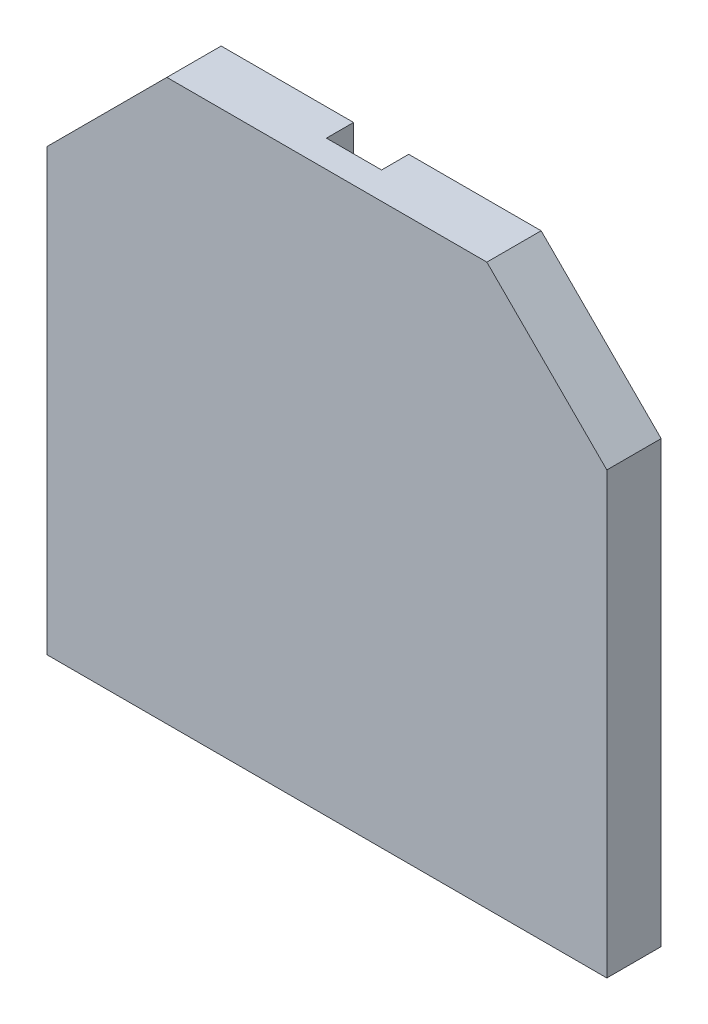
ISO-10303-21;
HEADER;
FILE_DESCRIPTION(('STEP AP214'),'2;1');
FILE_NAME('part.step','',(''),(''),'','','');
FILE_SCHEMA(('AUTOMOTIVE_DESIGN { 1 0 10303 214 1 1 1 1 }'));
ENDSEC;
DATA;
#1=APPLICATION_CONTEXT('core data for automotive mechanical design processes');
#2=APPLICATION_PROTOCOL_DEFINITION('international standard','automotive_design',2000,#1);
#3=PRODUCT_CONTEXT('',#1,'mechanical');
#4=PRODUCT('Part','Part','',(#3));
#5=PRODUCT_RELATED_PRODUCT_CATEGORY('part','',(#4));
#6=PRODUCT_DEFINITION_FORMATION('','',#4);
#7=PRODUCT_DEFINITION_CONTEXT('part definition',#1,'design');
#8=PRODUCT_DEFINITION('design','',#6,#7);
#9=PRODUCT_DEFINITION_SHAPE('','',#8);
#10=(LENGTH_UNIT() NAMED_UNIT(*) SI_UNIT(.MILLI.,.METRE.));
#11=(NAMED_UNIT(*) PLANE_ANGLE_UNIT() SI_UNIT($,.RADIAN.));
#12=(NAMED_UNIT(*) SI_UNIT($,.STERADIAN.) SOLID_ANGLE_UNIT());
#13=UNCERTAINTY_MEASURE_WITH_UNIT(LENGTH_MEASURE(1.E-05),#10,'distance_accuracy_value','');
#14=(GEOMETRIC_REPRESENTATION_CONTEXT(3) GLOBAL_UNCERTAINTY_ASSIGNED_CONTEXT((#13)) GLOBAL_UNIT_ASSIGNED_CONTEXT((#10,
#11,#12)) REPRESENTATION_CONTEXT('',''));
#15=CARTESIAN_POINT('',(0.,0.,0.));
#16=DIRECTION('',(0.,0.,1.));
#17=DIRECTION('',(1.,0.,0.));
#18=AXIS2_PLACEMENT_3D('',#15,#16,#17);
#19=CARTESIAN_POINT('',(-0.32500316,0.68579492,0.31999936));
#20=DIRECTION('',(0.,0.,-1.));
#21=DIRECTION('',(-1.,0.,0.));
#22=AXIS2_PLACEMENT_3D('',#19,#20,#21);
#23=PLANE('',#22);
#24=DIRECTION('',(-1.,0.,0.));
#25=VECTOR('',#24,1.);
#26=CARTESIAN_POINT('',(-0.32500316,0.48579532,0.31999936));
#27=LINE('',#26,#25);
#28=CARTESIAN_POINT('',(-0.32500316,0.48579532,0.31999936));
#29=VERTEX_POINT('',#28);
#30=CARTESIAN_POINT('',(0.32499808,0.48579532,0.31999936));
#31=VERTEX_POINT('',#30);
#32=EDGE_CURVE('E20',#29,#31,#27,.F.);
#33=ORIENTED_EDGE('',*,*,#32,.T.);
#34=DIRECTION('',(0.,1.,0.));
#35=VECTOR('',#34,1.);
#36=CARTESIAN_POINT('',(0.32499808,-1.91420496,0.31999936));
#37=LINE('',#36,#35);
#38=CARTESIAN_POINT('',(0.32499808,-1.91420496,0.31999936));
#39=VERTEX_POINT('',#38);
#40=EDGE_CURVE('E115',#39,#31,#37,.T.);
#41=ORIENTED_EDGE('',*,*,#40,.F.);
#42=DIRECTION('',(1.,0.,0.));
#43=VECTOR('',#42,1.);
#44=CARTESIAN_POINT('',(-0.32500316,-1.91420496,0.31999936));
#45=LINE('',#44,#43);
#46=CARTESIAN_POINT('',(-0.32500316,-1.91420496,0.31999936));
#47=VERTEX_POINT('',#46);
#48=EDGE_CURVE('E132',#47,#39,#45,.T.);
#49=ORIENTED_EDGE('',*,*,#48,.F.);
#50=DIRECTION('',(0.,1.,0.));
#51=VECTOR('',#50,1.);
#52=CARTESIAN_POINT('',(-0.32500316,0.68579492,0.31999936));
#53=LINE('',#52,#51);
#54=EDGE_CURVE('E120',#29,#47,#53,.F.);
#55=ORIENTED_EDGE('',*,*,#54,.F.);
#56=EDGE_LOOP('',(#33,#41,#49,#55));
#57=FACE_BOUND('',#56,.T.);
#58=ADVANCED_FACE('F17',(#57),#23,.T.);
#59=CARTESIAN_POINT('',(-0.32500316,-3.71420136,0.31999936));
#60=DIRECTION('',(0.,0.,-1.));
#61=DIRECTION('',(-1.,0.,0.));
#62=AXIS2_PLACEMENT_3D('',#59,#60,#61);
#63=PLANE('',#62);
#64=DIRECTION('',(-1.,0.,0.));
#65=VECTOR('',#64,1.);
#66=CARTESIAN_POINT('',(-0.32500316,-6.11420164,0.31999936));
#67=LINE('',#66,#65);
#68=CARTESIAN_POINT('',(0.32499808,-6.11420164,0.31999936));
#69=VERTEX_POINT('',#68);
#70=CARTESIAN_POINT('',(-0.32500316,-6.11420164,0.31999936));
#71=VERTEX_POINT('',#70);
#72=EDGE_CURVE('E123',#69,#71,#67,.T.);
#73=ORIENTED_EDGE('',*,*,#72,.T.);
#74=DIRECTION('',(0.,1.,0.));
#75=VECTOR('',#74,1.);
#76=CARTESIAN_POINT('',(-0.32500316,-3.71420136,0.31999936));
#77=LINE('',#76,#75);
#78=CARTESIAN_POINT('',(-0.32500316,-3.71420136,0.31999936));
#79=VERTEX_POINT('',#78);
#80=EDGE_CURVE('E148',#79,#71,#77,.F.);
#81=ORIENTED_EDGE('',*,*,#80,.F.);
#82=DIRECTION('',(1.,0.,0.));
#83=VECTOR('',#82,1.);
#84=CARTESIAN_POINT('',(0.32499808,-3.71420136,0.31999936));
#85=LINE('',#84,#83);
#86=CARTESIAN_POINT('',(0.32499808,-3.71420136,0.31999936));
#87=VERTEX_POINT('',#86);
#88=EDGE_CURVE('E153',#87,#79,#85,.F.);
#89=ORIENTED_EDGE('',*,*,#88,.F.);
#90=DIRECTION('',(0.,1.,0.));
#91=VECTOR('',#90,1.);
#92=CARTESIAN_POINT('',(0.32499808,-6.31420124,0.31999936));
#93=LINE('',#92,#91);
#94=EDGE_CURVE('E165',#69,#87,#93,.T.);
#95=ORIENTED_EDGE('',*,*,#94,.F.);
#96=EDGE_LOOP('',(#73,#81,#89,#95));
#97=FACE_BOUND('',#96,.T.);
#98=ADVANCED_FACE('F251',(#97),#63,.T.);
#99=CARTESIAN_POINT('',(0.32499808,-1.91420496,-1.00000054));
#100=DIRECTION('',(-1.,0.,0.));
#101=DIRECTION('',(0.,0.,1.));
#102=AXIS2_PLACEMENT_3D('',#99,#100,#101);
#103=PLANE('',#102);
#104=DIRECTION('',(0.,0.,1.));
#105=VECTOR('',#104,1.);
#106=CARTESIAN_POINT('',(0.32499808,0.48579532,-1.00000054));
#107=LINE('',#106,#105);
#108=CARTESIAN_POINT('',(0.32499808,0.48579532,0.));
#109=VERTEX_POINT('',#108);
#110=EDGE_CURVE('E125',#31,#109,#107,.F.);
#111=ORIENTED_EDGE('',*,*,#110,.T.);
#112=DIRECTION('',(0.,1.,0.));
#113=VECTOR('',#112,1.);
#114=CARTESIAN_POINT('',(0.32499808,0.48579532,0.));
#115=LINE('',#114,#113);
#116=CARTESIAN_POINT('',(0.32499808,-1.91420496,0.));
#117=VERTEX_POINT('',#116);
#118=EDGE_CURVE('E168',#109,#117,#115,.F.);
#119=ORIENTED_EDGE('',*,*,#118,.T.);
#120=DIRECTION('',(0.,0.,1.));
#121=VECTOR('',#120,1.);
#122=CARTESIAN_POINT('',(0.32499808,-1.91420496,-1.00000054));
#123=LINE('',#122,#121);
#124=EDGE_CURVE('E136',#39,#117,#123,.F.);
#125=ORIENTED_EDGE('',*,*,#124,.F.);
#126=ORIENTED_EDGE('',*,*,#40,.T.);
#127=EDGE_LOOP('',(#111,#119,#125,#126));
#128=FACE_BOUND('',#127,.T.);
#129=ADVANCED_FACE('F134',(#128),#103,.T.);
#130=CARTESIAN_POINT('',(-0.32500316,-1.91420496,-1.00000054));
#131=DIRECTION('',(0.,1.,0.));
#132=DIRECTION('',(0.,0.,1.));
#133=AXIS2_PLACEMENT_3D('',#130,#131,#132);
#134=PLANE('',#133);
#135=ORIENTED_EDGE('',*,*,#124,.T.);
#136=DIRECTION('',(1.,0.,0.));
#137=VECTOR('',#136,1.);
#138=CARTESIAN_POINT('',(-1.88578998,-1.91420496,0.));
#139=LINE('',#138,#137);
#140=CARTESIAN_POINT('',(-0.32500316,-1.91420496,0.));
#141=VERTEX_POINT('',#140);
#142=EDGE_CURVE('E170',#117,#141,#139,.F.);
#143=ORIENTED_EDGE('',*,*,#142,.T.);
#144=DIRECTION('',(0.,0.,-1.));
#145=VECTOR('',#144,1.);
#146=CARTESIAN_POINT('',(-0.32500316,-1.91420496,-1.00000054));
#147=LINE('',#146,#145);
#148=EDGE_CURVE('E142',#47,#141,#147,.T.);
#149=ORIENTED_EDGE('',*,*,#148,.F.);
#150=ORIENTED_EDGE('',*,*,#48,.T.);
#151=EDGE_LOOP('',(#135,#143,#149,#150));
#152=FACE_BOUND('',#151,.T.);
#153=ADVANCED_FACE('F271',(#152),#134,.T.);
#154=CARTESIAN_POINT('',(-0.32500316,0.68579492,-1.00000054));
#155=DIRECTION('',(1.,0.,0.));
#156=DIRECTION('',(0.,0.,-1.));
#157=AXIS2_PLACEMENT_3D('',#154,#155,#156);
#158=PLANE('',#157);
#159=DIRECTION('',(0.,0.,-1.));
#160=VECTOR('',#159,1.);
#161=CARTESIAN_POINT('',(-0.32500316,0.48579532,-1.00000054));
#162=LINE('',#161,#160);
#163=CARTESIAN_POINT('',(-0.32500316,0.48579532,0.));
#164=VERTEX_POINT('',#163);
#165=EDGE_CURVE('E145',#164,#29,#162,.F.);
#166=ORIENTED_EDGE('',*,*,#165,.T.);
#167=ORIENTED_EDGE('',*,*,#54,.T.);
#168=ORIENTED_EDGE('',*,*,#148,.T.);
#169=DIRECTION('',(0.,1.,0.));
#170=VECTOR('',#169,1.);
#171=CARTESIAN_POINT('',(-0.32500316,0.48579532,0.));
#172=LINE('',#171,#170);
#173=EDGE_CURVE('E172',#141,#164,#172,.T.);
#174=ORIENTED_EDGE('',*,*,#173,.T.);
#175=EDGE_LOOP('',(#166,#167,#168,#174));
#176=FACE_BOUND('',#175,.T.);
#177=ADVANCED_FACE('F268',(#176),#158,.T.);
#178=CARTESIAN_POINT('',(-0.32500316,-3.71420136,-1.00000054));
#179=DIRECTION('',(1.,0.,0.));
#180=DIRECTION('',(0.,0.,-1.));
#181=AXIS2_PLACEMENT_3D('',#178,#179,#180);
#182=PLANE('',#181);
#183=DIRECTION('',(0.,0.,-1.));
#184=VECTOR('',#183,1.);
#185=CARTESIAN_POINT('',(-0.32500316,-6.11420164,-1.00000054));
#186=LINE('',#185,#184);
#187=CARTESIAN_POINT('',(-0.32500316,-6.11420164,0.));
#188=VERTEX_POINT('',#187);
#189=EDGE_CURVE('E151',#71,#188,#186,.T.);
#190=ORIENTED_EDGE('',*,*,#189,.T.);
#191=DIRECTION('',(0.,1.,0.));
#192=VECTOR('',#191,1.);
#193=CARTESIAN_POINT('',(-0.32500316,0.48579532,0.));
#194=LINE('',#193,#192);
#195=CARTESIAN_POINT('',(-0.32500316,-3.71420136,0.));
#196=VERTEX_POINT('',#195);
#197=EDGE_CURVE('E175',#188,#196,#194,.T.);
#198=ORIENTED_EDGE('',*,*,#197,.T.);
#199=DIRECTION('',(0.,0.,-1.));
#200=VECTOR('',#199,1.);
#201=CARTESIAN_POINT('',(-0.32500316,-3.71420136,-1.00000054));
#202=LINE('',#201,#200);
#203=EDGE_CURVE('E156',#79,#196,#202,.T.);
#204=ORIENTED_EDGE('',*,*,#203,.F.);
#205=ORIENTED_EDGE('',*,*,#80,.T.);
#206=EDGE_LOOP('',(#190,#198,#204,#205));
#207=FACE_BOUND('',#206,.T.);
#208=ADVANCED_FACE('F245',(#207),#182,.T.);
#209=CARTESIAN_POINT('',(0.32499808,-3.71420136,-1.00000054));
#210=DIRECTION('',(0.,-1.,0.));
#211=DIRECTION('',(0.,0.,-1.));
#212=AXIS2_PLACEMENT_3D('',#209,#210,#211);
#213=PLANE('',#212);
#214=ORIENTED_EDGE('',*,*,#203,.T.);
#215=DIRECTION('',(1.,0.,0.));
#216=VECTOR('',#215,1.);
#217=CARTESIAN_POINT('',(-1.88578998,-3.71420136,0.));
#218=LINE('',#217,#216);
#219=CARTESIAN_POINT('',(0.32499808,-3.71420136,0.));
#220=VERTEX_POINT('',#219);
#221=EDGE_CURVE('E177',#196,#220,#218,.T.);
#222=ORIENTED_EDGE('',*,*,#221,.T.);
#223=DIRECTION('',(0.,0.,1.));
#224=VECTOR('',#223,1.);
#225=CARTESIAN_POINT('',(0.32499808,-3.71420136,-1.00000054));
#226=LINE('',#225,#224);
#227=EDGE_CURVE('E159',#87,#220,#226,.F.);
#228=ORIENTED_EDGE('',*,*,#227,.F.);
#229=ORIENTED_EDGE('',*,*,#88,.T.);
#230=EDGE_LOOP('',(#214,#222,#228,#229));
#231=FACE_BOUND('',#230,.T.);
#232=ADVANCED_FACE('F247',(#231),#213,.T.);
#233=CARTESIAN_POINT('',(0.32499808,-6.31420124,-1.00000054));
#234=DIRECTION('',(-1.,0.,0.));
#235=DIRECTION('',(0.,0.,1.));
#236=AXIS2_PLACEMENT_3D('',#233,#234,#235);
#237=PLANE('',#236);
#238=DIRECTION('',(0.,0.,1.));
#239=VECTOR('',#238,1.);
#240=CARTESIAN_POINT('',(0.32499808,-6.11420164,-1.00000054));
#241=LINE('',#240,#239);
#242=CARTESIAN_POINT('',(0.32499808,-6.11420164,0.));
#243=VERTEX_POINT('',#242);
#244=EDGE_CURVE('E162',#243,#69,#241,.T.);
#245=ORIENTED_EDGE('',*,*,#244,.T.);
#246=ORIENTED_EDGE('',*,*,#94,.T.);
#247=ORIENTED_EDGE('',*,*,#227,.T.);
#248=DIRECTION('',(0.,1.,0.));
#249=VECTOR('',#248,1.);
#250=CARTESIAN_POINT('',(0.32499808,0.48579532,0.));
#251=LINE('',#250,#249);
#252=EDGE_CURVE('E179',#220,#243,#251,.F.);
#253=ORIENTED_EDGE('',*,*,#252,.T.);
#254=EDGE_LOOP('',(#245,#246,#247,#253));
#255=FACE_BOUND('',#254,.T.);
#256=ADVANCED_FACE('F255',(#255),#237,.T.);
#257=CARTESIAN_POINT('',(-1.88578998,0.48579532,0.));
#258=DIRECTION('',(0.,0.,1.));
#259=DIRECTION('',(1.,0.,0.));
#260=AXIS2_PLACEMENT_3D('',#257,#258,#259);
#261=PLANE('',#260);
#262=DIRECTION('',(-0.707106781186548,0.707106781186548,0.));
#263=VECTOR('',#262,1.);
#264=CARTESIAN_POINT('',(1.8857849,0.48579532,0.));
#265=LINE('',#264,#263);
#266=CARTESIAN_POINT('',(3.29999848,-0.92841826,0.));
#267=VERTEX_POINT('',#266);
#268=CARTESIAN_POINT('',(1.8857849,0.48579532,0.));
#269=VERTEX_POINT('',#268);
#270=EDGE_CURVE('E182',#267,#269,#265,.T.);
#271=ORIENTED_EDGE('',*,*,#270,.F.);
#272=DIRECTION('',(0.,1.,0.));
#273=VECTOR('',#272,1.);
#274=CARTESIAN_POINT('',(3.29999848,-0.92841826,0.));
#275=LINE('',#274,#273);
#276=CARTESIAN_POINT('',(3.29999848,-6.11420164,0.));
#277=VERTEX_POINT('',#276);
#278=EDGE_CURVE('E209',#277,#267,#275,.T.);
#279=ORIENTED_EDGE('',*,*,#278,.F.);
#280=DIRECTION('',(1.,0.,0.));
#281=VECTOR('',#280,1.);
#282=CARTESIAN_POINT('',(3.29999848,-6.11420164,0.));
#283=LINE('',#282,#281);
#284=EDGE_CURVE('E206',#243,#277,#283,.T.);
#285=ORIENTED_EDGE('',*,*,#284,.F.);
#286=ORIENTED_EDGE('',*,*,#252,.F.);
#287=ORIENTED_EDGE('',*,*,#221,.F.);
#288=ORIENTED_EDGE('',*,*,#197,.F.);
#289=DIRECTION('',(1.,0.,0.));
#290=VECTOR('',#289,1.);
#291=CARTESIAN_POINT('',(3.29999848,-6.11420164,0.));
#292=LINE('',#291,#290);
#293=CARTESIAN_POINT('',(-3.30000356,-6.11420164,0.));
#294=VERTEX_POINT('',#293);
#295=EDGE_CURVE('E203',#294,#188,#292,.T.);
#296=ORIENTED_EDGE('',*,*,#295,.F.);
#297=DIRECTION('',(0.,1.,0.));
#298=VECTOR('',#297,1.);
#299=CARTESIAN_POINT('',(-3.30000356,-6.11420164,0.));
#300=LINE('',#299,#298);
#301=CARTESIAN_POINT('',(-3.30000356,-0.92841826,0.));
#302=VERTEX_POINT('',#301);
#303=EDGE_CURVE('E198',#302,#294,#300,.F.);
#304=ORIENTED_EDGE('',*,*,#303,.F.);
#305=DIRECTION('',(-0.707106781186548,-0.707106781186548,0.));
#306=VECTOR('',#305,1.);
#307=CARTESIAN_POINT('',(-3.30000356,-0.92841826,0.));
#308=LINE('',#307,#306);
#309=CARTESIAN_POINT('',(-1.88578998,0.48579532,0.));
#310=VERTEX_POINT('',#309);
#311=EDGE_CURVE('E193',#310,#302,#308,.T.);
#312=ORIENTED_EDGE('',*,*,#311,.F.);
#313=DIRECTION('',(1.,0.,0.));
#314=VECTOR('',#313,1.);
#315=CARTESIAN_POINT('',(-1.88578998,0.48579532,0.));
#316=LINE('',#315,#314);
#317=EDGE_CURVE('E186',#164,#310,#316,.F.);
#318=ORIENTED_EDGE('',*,*,#317,.F.);
#319=ORIENTED_EDGE('',*,*,#173,.F.);
#320=ORIENTED_EDGE('',*,*,#142,.F.);
#321=ORIENTED_EDGE('',*,*,#118,.F.);
#322=DIRECTION('',(1.,0.,0.));
#323=VECTOR('',#322,1.);
#324=CARTESIAN_POINT('',(-1.88578998,0.48579532,0.));
#325=LINE('',#324,#323);
#326=EDGE_CURVE('E129',#269,#109,#325,.F.);
#327=ORIENTED_EDGE('',*,*,#326,.F.);
#328=EDGE_LOOP('',(#271,#279,#285,#286,#287,#288,#296,#304,#312,#318,#319,#320,#321,#327));
#329=FACE_BOUND('',#328,.T.);
#330=ADVANCED_FACE('F240',(#329),#261,.F.);
#331=CARTESIAN_POINT('',(1.8857849,0.48579532,0.));
#332=DIRECTION('',(0.707106781186548,0.707106781186548,0.));
#333=DIRECTION('',(-0.707106781186548,0.707106781186548,0.));
#334=AXIS2_PLACEMENT_3D('',#331,#332,#333);
#335=PLANE('',#334);
#336=DIRECTION('',(0.,0.,1.));
#337=VECTOR('',#336,1.);
#338=CARTESIAN_POINT('',(1.8857849,0.48579532,0.));
#339=LINE('',#338,#337);
#340=CARTESIAN_POINT('',(1.8857849,0.48579532,0.64000126));
#341=VERTEX_POINT('',#340);
#342=EDGE_CURVE('E188',#341,#269,#339,.F.);
#343=ORIENTED_EDGE('',*,*,#342,.F.);
#344=DIRECTION('',(-0.707106781186547,0.707106781186547,0.));
#345=VECTOR('',#344,1.);
#346=CARTESIAN_POINT('',(3.29999848,-0.92841826,0.64000126));
#347=LINE('',#346,#345);
#348=CARTESIAN_POINT('',(3.29999848,-0.92841826,0.64000126));
#349=VERTEX_POINT('',#348);
#350=EDGE_CURVE('E215',#349,#341,#347,.T.);
#351=ORIENTED_EDGE('',*,*,#350,.F.);
#352=DIRECTION('',(0.,0.,-1.));
#353=VECTOR('',#352,1.);
#354=CARTESIAN_POINT('',(3.29999848,-0.92841826,0.));
#355=LINE('',#354,#353);
#356=EDGE_CURVE('E212',#267,#349,#355,.F.);
#357=ORIENTED_EDGE('',*,*,#356,.F.);
#358=ORIENTED_EDGE('',*,*,#270,.T.);
#359=EDGE_LOOP('',(#343,#351,#357,#358));
#360=FACE_BOUND('',#359,.T.);
#361=ADVANCED_FACE('F260',(#360),#335,.T.);
#362=CARTESIAN_POINT('',(-1.88578998,0.48579532,0.));
#363=DIRECTION('',(0.,1.,0.));
#364=DIRECTION('',(0.,0.,1.));
#365=AXIS2_PLACEMENT_3D('',#362,#363,#364);
#366=PLANE('',#365);
#367=DIRECTION('',(1.,0.,0.));
#368=VECTOR('',#367,1.);
#369=CARTESIAN_POINT('',(-1.88578998,0.48579532,0.64000126));
#370=LINE('',#369,#368);
#371=CARTESIAN_POINT('',(-1.88578998,0.48579532,0.64000126));
#372=VERTEX_POINT('',#371);
#373=EDGE_CURVE('E218',#341,#372,#370,.F.);
#374=ORIENTED_EDGE('',*,*,#373,.F.);
#375=ORIENTED_EDGE('',*,*,#342,.T.);
#376=ORIENTED_EDGE('',*,*,#326,.T.);
#377=ORIENTED_EDGE('',*,*,#110,.F.);
#378=ORIENTED_EDGE('',*,*,#32,.F.);
#379=ORIENTED_EDGE('',*,*,#165,.F.);
#380=ORIENTED_EDGE('',*,*,#317,.T.);
#381=DIRECTION('',(0.,0.,1.));
#382=VECTOR('',#381,1.);
#383=CARTESIAN_POINT('',(-1.88578998,0.48579532,0.));
#384=LINE('',#383,#382);
#385=EDGE_CURVE('E190',#372,#310,#384,.F.);
#386=ORIENTED_EDGE('',*,*,#385,.F.);
#387=EDGE_LOOP('',(#374,#375,#376,#377,#378,#379,#380,#386));
#388=FACE_BOUND('',#387,.T.);
#389=ADVANCED_FACE('F127',(#388),#366,.T.);
#390=CARTESIAN_POINT('',(-3.30000356,-0.92841826,0.));
#391=DIRECTION('',(-0.707106781186548,0.707106781186548,0.));
#392=DIRECTION('',(-0.707106781186548,-0.707106781186548,0.));
#393=AXIS2_PLACEMENT_3D('',#390,#391,#392);
#394=PLANE('',#393);
#395=DIRECTION('',(0.,0.,1.));
#396=VECTOR('',#395,1.);
#397=CARTESIAN_POINT('',(-3.30000356,-0.92841826,0.));
#398=LINE('',#397,#396);
#399=CARTESIAN_POINT('',(-3.30000356,-0.92841826,0.64000126));
#400=VERTEX_POINT('',#399);
#401=EDGE_CURVE('E195',#400,#302,#398,.F.);
#402=ORIENTED_EDGE('',*,*,#401,.F.);
#403=DIRECTION('',(-0.707106781186547,-0.707106781186547,0.));
#404=VECTOR('',#403,1.);
#405=CARTESIAN_POINT('',(-1.88578998,0.48579532,0.64000126));
#406=LINE('',#405,#404);
#407=EDGE_CURVE('E221',#372,#400,#406,.T.);
#408=ORIENTED_EDGE('',*,*,#407,.F.);
#409=ORIENTED_EDGE('',*,*,#385,.T.);
#410=ORIENTED_EDGE('',*,*,#311,.T.);
#411=EDGE_LOOP('',(#402,#408,#409,#410));
#412=FACE_BOUND('',#411,.T.);
#413=ADVANCED_FACE('F264',(#412),#394,.T.);
#414=CARTESIAN_POINT('',(-3.30000356,-6.11420164,0.));
#415=DIRECTION('',(-1.,0.,0.));
#416=DIRECTION('',(0.,0.,1.));
#417=AXIS2_PLACEMENT_3D('',#414,#415,#416);
#418=PLANE('',#417);
#419=DIRECTION('',(0.,0.,-1.));
#420=VECTOR('',#419,1.);
#421=CARTESIAN_POINT('',(-3.30000356,-6.11420164,0.));
#422=LINE('',#421,#420);
#423=CARTESIAN_POINT('',(-3.30000356,-6.11420164,0.64000126));
#424=VERTEX_POINT('',#423);
#425=EDGE_CURVE('E200',#424,#294,#422,.T.);
#426=ORIENTED_EDGE('',*,*,#425,.F.);
#427=DIRECTION('',(0.,1.,0.));
#428=VECTOR('',#427,1.);
#429=CARTESIAN_POINT('',(-3.30000356,0.48579532,0.64000126));
#430=LINE('',#429,#428);
#431=EDGE_CURVE('E224',#400,#424,#430,.F.);
#432=ORIENTED_EDGE('',*,*,#431,.F.);
#433=ORIENTED_EDGE('',*,*,#401,.T.);
#434=ORIENTED_EDGE('',*,*,#303,.T.);
#435=EDGE_LOOP('',(#426,#432,#433,#434));
#436=FACE_BOUND('',#435,.T.);
#437=ADVANCED_FACE('F235',(#436),#418,.T.);
#438=CARTESIAN_POINT('',(3.29999848,-6.11420164,0.));
#439=DIRECTION('',(0.,-1.,0.));
#440=DIRECTION('',(0.,0.,-1.));
#441=AXIS2_PLACEMENT_3D('',#438,#439,#440);
#442=PLANE('',#441);
#443=ORIENTED_EDGE('',*,*,#284,.T.);
#444=DIRECTION('',(0.,0.,-1.));
#445=VECTOR('',#444,1.);
#446=CARTESIAN_POINT('',(3.29999848,-6.11420164,0.));
#447=LINE('',#446,#445);
#448=CARTESIAN_POINT('',(3.29999848,-6.11420164,0.64000126));
#449=VERTEX_POINT('',#448);
#450=EDGE_CURVE('E35',#449,#277,#447,.T.);
#451=ORIENTED_EDGE('',*,*,#450,.F.);
#452=DIRECTION('',(1.,0.,0.));
#453=VECTOR('',#452,1.);
#454=CARTESIAN_POINT('',(-1.88578998,-6.11420164,0.64000126));
#455=LINE('',#454,#453);
#456=EDGE_CURVE('E26',#424,#449,#455,.T.);
#457=ORIENTED_EDGE('',*,*,#456,.F.);
#458=ORIENTED_EDGE('',*,*,#425,.T.);
#459=ORIENTED_EDGE('',*,*,#295,.T.);
#460=ORIENTED_EDGE('',*,*,#189,.F.);
#461=ORIENTED_EDGE('',*,*,#72,.F.);
#462=ORIENTED_EDGE('',*,*,#244,.F.);
#463=EDGE_LOOP('',(#443,#451,#457,#458,#459,#460,#461,#462));
#464=FACE_BOUND('',#463,.T.);
#465=ADVANCED_FACE('F231',(#464),#442,.T.);
#466=CARTESIAN_POINT('',(3.29999848,-0.92841826,0.));
#467=DIRECTION('',(1.,0.,0.));
#468=DIRECTION('',(0.,0.,-1.));
#469=AXIS2_PLACEMENT_3D('',#466,#467,#468);
#470=PLANE('',#469);
#471=ORIENTED_EDGE('',*,*,#356,.T.);
#472=DIRECTION('',(0.,1.,0.));
#473=VECTOR('',#472,1.);
#474=CARTESIAN_POINT('',(3.29999848,0.48579532,0.64000126));
#475=LINE('',#474,#473);
#476=EDGE_CURVE('E11',#449,#349,#475,.T.);
#477=ORIENTED_EDGE('',*,*,#476,.F.);
#478=ORIENTED_EDGE('',*,*,#450,.T.);
#479=ORIENTED_EDGE('',*,*,#278,.T.);
#480=EDGE_LOOP('',(#471,#477,#478,#479));
#481=FACE_BOUND('',#480,.T.);
#482=ADVANCED_FACE('F258',(#481),#470,.T.);
#483=CARTESIAN_POINT('',(-1.88578998,0.48579532,0.64000126));
#484=DIRECTION('',(0.,0.,1.));
#485=DIRECTION('',(1.,0.,0.));
#486=AXIS2_PLACEMENT_3D('',#483,#484,#485);
#487=PLANE('',#486);
#488=ORIENTED_EDGE('',*,*,#456,.T.);
#489=ORIENTED_EDGE('',*,*,#476,.T.);
#490=ORIENTED_EDGE('',*,*,#350,.T.);
#491=ORIENTED_EDGE('',*,*,#373,.T.);
#492=ORIENTED_EDGE('',*,*,#407,.T.);
#493=ORIENTED_EDGE('',*,*,#431,.T.);
#494=EDGE_LOOP('',(#488,#489,#490,#491,#492,#493));
#495=FACE_BOUND('',#494,.T.);
#496=ADVANCED_FACE('F229',(#495),#487,.T.);
#497=CLOSED_SHELL('',(#58,#98,#129,#153,#177,#208,#232,#256,#330,#361,#389,#413,#437,#465,#482,#496));
#498=MANIFOLD_SOLID_BREP('B1',#497);
#499=ADVANCED_BREP_SHAPE_REPRESENTATION('',(#18,#498),#14);
#500=SHAPE_DEFINITION_REPRESENTATION(#9,#499);
ENDSEC;
END-ISO-10303-21;
